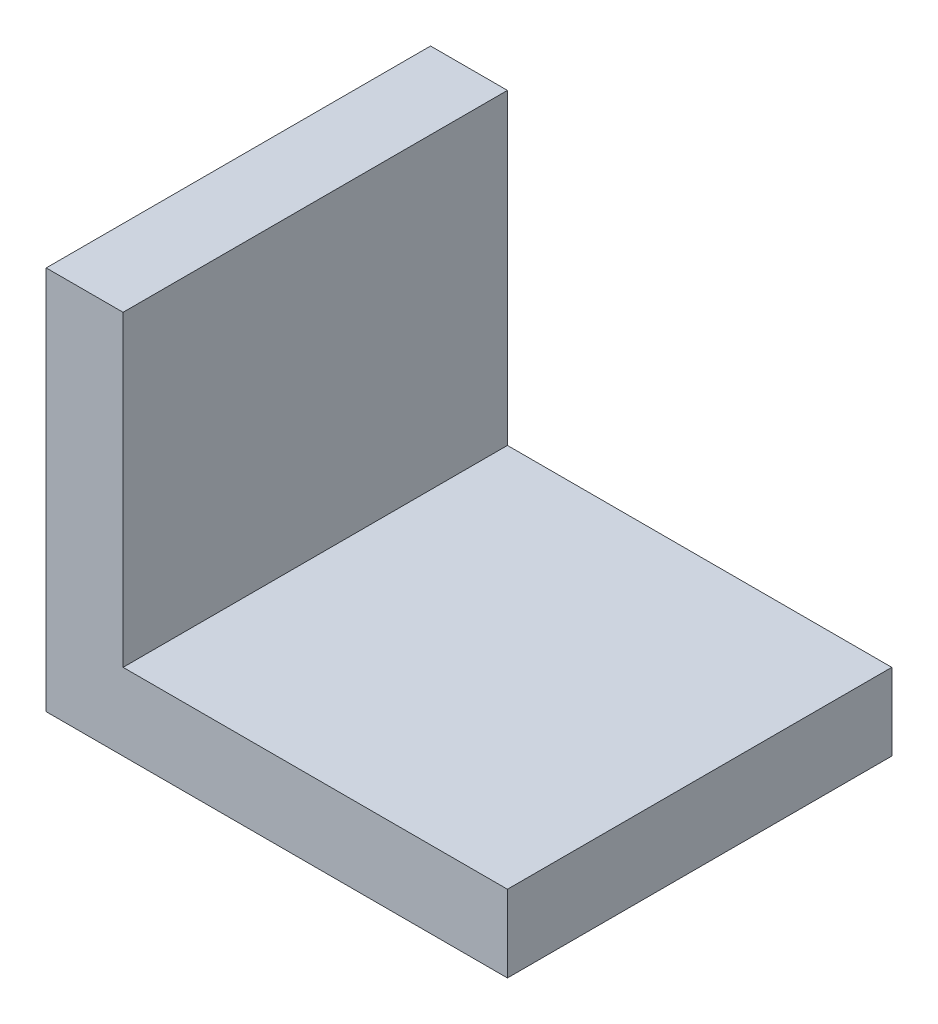
ISO-10303-21;
HEADER;
FILE_DESCRIPTION(('STEP AP214'),'2;1');
FILE_NAME('part.step','',(''),(''),'','','');
FILE_SCHEMA(('AUTOMOTIVE_DESIGN { 1 0 10303 214 1 1 1 1 }'));
ENDSEC;
DATA;
#1=APPLICATION_CONTEXT('core data for automotive mechanical design processes');
#2=APPLICATION_PROTOCOL_DEFINITION('international standard','automotive_design',2000,#1);
#3=PRODUCT_CONTEXT('',#1,'mechanical');
#4=PRODUCT('Part','Part','',(#3));
#5=PRODUCT_RELATED_PRODUCT_CATEGORY('part','',(#4));
#6=PRODUCT_DEFINITION_FORMATION('','',#4);
#7=PRODUCT_DEFINITION_CONTEXT('part definition',#1,'design');
#8=PRODUCT_DEFINITION('design','',#6,#7);
#9=PRODUCT_DEFINITION_SHAPE('','',#8);
#10=(LENGTH_UNIT() NAMED_UNIT(*) SI_UNIT(.MILLI.,.METRE.));
#11=(NAMED_UNIT(*) PLANE_ANGLE_UNIT() SI_UNIT($,.RADIAN.));
#12=(NAMED_UNIT(*) SI_UNIT($,.STERADIAN.) SOLID_ANGLE_UNIT());
#13=UNCERTAINTY_MEASURE_WITH_UNIT(LENGTH_MEASURE(1.E-05),#10,'distance_accuracy_value','');
#14=(GEOMETRIC_REPRESENTATION_CONTEXT(3) GLOBAL_UNCERTAINTY_ASSIGNED_CONTEXT((#13)) GLOBAL_UNIT_ASSIGNED_CONTEXT((#10,
#11,#12)) REPRESENTATION_CONTEXT('',''));
#15=CARTESIAN_POINT('',(0.,0.,0.));
#16=DIRECTION('',(0.,0.,1.));
#17=DIRECTION('',(1.,0.,0.));
#18=AXIS2_PLACEMENT_3D('',#15,#16,#17);
#19=CARTESIAN_POINT('',(6.,2.,-5.));
#20=DIRECTION('',(-1.,0.,0.));
#21=DIRECTION('',(0.,0.,1.));
#22=AXIS2_PLACEMENT_3D('',#19,#20,#21);
#23=PLANE('',#22);
#24=DIRECTION('',(0.,0.,-1.));
#25=VECTOR('',#24,1.);
#26=CARTESIAN_POINT('',(6.,0.,-5.));
#27=LINE('',#26,#25);
#28=CARTESIAN_POINT('',(6.,0.,5.));
#29=VERTEX_POINT('',#28);
#30=CARTESIAN_POINT('',(6.,0.,-5.));
#31=VERTEX_POINT('',#30);
#32=EDGE_CURVE('E97',#29,#31,#27,.T.);
#33=ORIENTED_EDGE('',*,*,#32,.T.);
#34=DIRECTION('',(0.,-1.,0.));
#35=VECTOR('',#34,1.);
#36=CARTESIAN_POINT('',(6.,2.,-5.));
#37=LINE('',#36,#35);
#38=CARTESIAN_POINT('',(6.,2.,-5.));
#39=VERTEX_POINT('',#38);
#40=EDGE_CURVE('E11',#39,#31,#37,.T.);
#41=ORIENTED_EDGE('',*,*,#40,.F.);
#42=DIRECTION('',(0.,0.,-1.));
#43=VECTOR('',#42,1.);
#44=CARTESIAN_POINT('',(6.,2.,-5.));
#45=LINE('',#44,#43);
#46=CARTESIAN_POINT('',(6.,2.,5.));
#47=VERTEX_POINT('',#46);
#48=EDGE_CURVE('E91',#47,#39,#45,.T.);
#49=ORIENTED_EDGE('',*,*,#48,.F.);
#50=DIRECTION('',(0.,-1.,0.));
#51=VECTOR('',#50,1.);
#52=CARTESIAN_POINT('',(6.,2.,5.));
#53=LINE('',#52,#51);
#54=EDGE_CURVE('E82',#47,#29,#53,.T.);
#55=ORIENTED_EDGE('',*,*,#54,.T.);
#56=EDGE_LOOP('',(#33,#41,#49,#55));
#57=FACE_BOUND('',#56,.T.);
#58=ADVANCED_FACE('F39',(#57),#23,.F.);
#59=CARTESIAN_POINT('',(-6.,2.,-5.));
#60=DIRECTION('',(0.,0.,1.));
#61=DIRECTION('',(1.,0.,0.));
#62=AXIS2_PLACEMENT_3D('',#59,#60,#61);
#63=PLANE('',#62);
#64=DIRECTION('',(-1.,0.,0.));
#65=VECTOR('',#64,1.);
#66=CARTESIAN_POINT('',(-6.,0.,-5.));
#67=LINE('',#66,#65);
#68=CARTESIAN_POINT('',(-6.,0.,-5.));
#69=VERTEX_POINT('',#68);
#70=EDGE_CURVE('E101',#31,#69,#67,.T.);
#71=ORIENTED_EDGE('',*,*,#70,.T.);
#72=DIRECTION('',(0.,-1.,0.));
#73=VECTOR('',#72,1.);
#74=CARTESIAN_POINT('',(-6.,2.,-5.));
#75=LINE('',#74,#73);
#76=CARTESIAN_POINT('',(-6.,10.,-5.));
#77=VERTEX_POINT('',#76);
#78=EDGE_CURVE('E47',#77,#69,#75,.T.);
#79=ORIENTED_EDGE('',*,*,#78,.F.);
#80=DIRECTION('',(-1.,0.,0.));
#81=VECTOR('',#80,1.);
#82=CARTESIAN_POINT('',(-6.,10.,-5.));
#83=LINE('',#82,#81);
#84=CARTESIAN_POINT('',(-4.,10.,-5.));
#85=VERTEX_POINT('',#84);
#86=EDGE_CURVE('E131',#85,#77,#83,.T.);
#87=ORIENTED_EDGE('',*,*,#86,.F.);
#88=DIRECTION('',(0.,-1.,0.));
#89=VECTOR('',#88,1.);
#90=CARTESIAN_POINT('',(-4.,10.,-5.));
#91=LINE('',#90,#89);
#92=CARTESIAN_POINT('',(-4.,2.,-5.));
#93=VERTEX_POINT('',#92);
#94=EDGE_CURVE('E109',#85,#93,#91,.T.);
#95=ORIENTED_EDGE('',*,*,#94,.T.);
#96=DIRECTION('',(-1.,0.,0.));
#97=VECTOR('',#96,1.);
#98=CARTESIAN_POINT('',(-6.,2.,-5.));
#99=LINE('',#98,#97);
#100=EDGE_CURVE('E153',#39,#93,#99,.T.);
#101=ORIENTED_EDGE('',*,*,#100,.F.);
#102=ORIENTED_EDGE('',*,*,#40,.T.);
#103=EDGE_LOOP('',(#71,#79,#87,#95,#101,#102));
#104=FACE_BOUND('',#103,.T.);
#105=ADVANCED_FACE('F128',(#104),#63,.F.);
#106=CARTESIAN_POINT('',(-6.,2.,-5.));
#107=DIRECTION('',(1.,0.,0.));
#108=DIRECTION('',(0.,0.,-1.));
#109=AXIS2_PLACEMENT_3D('',#106,#107,#108);
#110=PLANE('',#109);
#111=DIRECTION('',(0.,0.,1.));
#112=VECTOR('',#111,1.);
#113=CARTESIAN_POINT('',(-6.,0.,-5.));
#114=LINE('',#113,#112);
#115=CARTESIAN_POINT('',(-6.,0.,5.));
#116=VERTEX_POINT('',#115);
#117=EDGE_CURVE('E92',#69,#116,#114,.T.);
#118=ORIENTED_EDGE('',*,*,#117,.T.);
#119=DIRECTION('',(0.,-1.,0.));
#120=VECTOR('',#119,1.);
#121=CARTESIAN_POINT('',(-6.,2.,5.));
#122=LINE('',#121,#120);
#123=CARTESIAN_POINT('',(-6.,10.,5.));
#124=VERTEX_POINT('',#123);
#125=EDGE_CURVE('E86',#124,#116,#122,.T.);
#126=ORIENTED_EDGE('',*,*,#125,.F.);
#127=DIRECTION('',(0.,0.,1.));
#128=VECTOR('',#127,1.);
#129=CARTESIAN_POINT('',(-6.,10.,-5.));
#130=LINE('',#129,#128);
#131=EDGE_CURVE('E124',#77,#124,#130,.T.);
#132=ORIENTED_EDGE('',*,*,#131,.F.);
#133=ORIENTED_EDGE('',*,*,#78,.T.);
#134=EDGE_LOOP('',(#118,#126,#132,#133));
#135=FACE_BOUND('',#134,.T.);
#136=ADVANCED_FACE('F122',(#135),#110,.F.);
#137=CARTESIAN_POINT('',(-6.,2.,5.));
#138=DIRECTION('',(0.,0.,-1.));
#139=DIRECTION('',(-1.,0.,0.));
#140=AXIS2_PLACEMENT_3D('',#137,#138,#139);
#141=PLANE('',#140);
#142=DIRECTION('',(1.,0.,0.));
#143=VECTOR('',#142,1.);
#144=CARTESIAN_POINT('',(-6.,0.,5.));
#145=LINE('',#144,#143);
#146=EDGE_CURVE('E79',#116,#29,#145,.T.);
#147=ORIENTED_EDGE('',*,*,#146,.T.);
#148=ORIENTED_EDGE('',*,*,#54,.F.);
#149=DIRECTION('',(1.,0.,0.));
#150=VECTOR('',#149,1.);
#151=CARTESIAN_POINT('',(-6.,2.,5.));
#152=LINE('',#151,#150);
#153=CARTESIAN_POINT('',(-4.,2.,5.));
#154=VERTEX_POINT('',#153);
#155=EDGE_CURVE('E59',#154,#47,#152,.T.);
#156=ORIENTED_EDGE('',*,*,#155,.F.);
#157=DIRECTION('',(0.,-1.,0.));
#158=VECTOR('',#157,1.);
#159=CARTESIAN_POINT('',(-4.,10.,5.));
#160=LINE('',#159,#158);
#161=CARTESIAN_POINT('',(-4.,10.,5.));
#162=VERTEX_POINT('',#161);
#163=EDGE_CURVE('E103',#162,#154,#160,.T.);
#164=ORIENTED_EDGE('',*,*,#163,.F.);
#165=DIRECTION('',(1.,0.,0.));
#166=VECTOR('',#165,1.);
#167=CARTESIAN_POINT('',(-6.,10.,5.));
#168=LINE('',#167,#166);
#169=EDGE_CURVE('E146',#124,#162,#168,.T.);
#170=ORIENTED_EDGE('',*,*,#169,.F.);
#171=ORIENTED_EDGE('',*,*,#125,.T.);
#172=EDGE_LOOP('',(#147,#148,#156,#164,#170,#171));
#173=FACE_BOUND('',#172,.T.);
#174=ADVANCED_FACE('F81',(#173),#141,.F.);
#175=CARTESIAN_POINT('',(0.,2.,0.));
#176=DIRECTION('',(0.,1.,0.));
#177=DIRECTION('',(0.,0.,1.));
#178=AXIS2_PLACEMENT_3D('',#175,#176,#177);
#179=PLANE('',#178);
#180=DIRECTION('',(0.,0.,-1.));
#181=VECTOR('',#180,1.);
#182=CARTESIAN_POINT('',(-4.,2.,-5.));
#183=LINE('',#182,#181);
#184=EDGE_CURVE('E54',#154,#93,#183,.T.);
#185=ORIENTED_EDGE('',*,*,#184,.F.);
#186=ORIENTED_EDGE('',*,*,#155,.T.);
#187=ORIENTED_EDGE('',*,*,#48,.T.);
#188=ORIENTED_EDGE('',*,*,#100,.T.);
#189=EDGE_LOOP('',(#185,#186,#187,#188));
#190=FACE_BOUND('',#189,.T.);
#191=ADVANCED_FACE('F157',(#190),#179,.T.);
#192=CARTESIAN_POINT('',(0.,0.,0.));
#193=DIRECTION('',(0.,1.,0.));
#194=DIRECTION('',(0.,0.,1.));
#195=AXIS2_PLACEMENT_3D('',#192,#193,#194);
#196=PLANE('',#195);
#197=ORIENTED_EDGE('',*,*,#32,.F.);
#198=ORIENTED_EDGE('',*,*,#146,.F.);
#199=ORIENTED_EDGE('',*,*,#117,.F.);
#200=ORIENTED_EDGE('',*,*,#70,.F.);
#201=EDGE_LOOP('',(#197,#198,#199,#200));
#202=FACE_BOUND('',#201,.T.);
#203=ADVANCED_FACE('F100',(#202),#196,.F.);
#204=CARTESIAN_POINT('',(-4.,10.,-5.));
#205=DIRECTION('',(-1.,0.,0.));
#206=DIRECTION('',(0.,0.,1.));
#207=AXIS2_PLACEMENT_3D('',#204,#205,#206);
#208=PLANE('',#207);
#209=ORIENTED_EDGE('',*,*,#184,.T.);
#210=ORIENTED_EDGE('',*,*,#94,.F.);
#211=DIRECTION('',(0.,0.,-1.));
#212=VECTOR('',#211,1.);
#213=CARTESIAN_POINT('',(-4.,10.,-5.));
#214=LINE('',#213,#212);
#215=EDGE_CURVE('E139',#162,#85,#214,.T.);
#216=ORIENTED_EDGE('',*,*,#215,.F.);
#217=ORIENTED_EDGE('',*,*,#163,.T.);
#218=EDGE_LOOP('',(#209,#210,#216,#217));
#219=FACE_BOUND('',#218,.T.);
#220=ADVANCED_FACE('F159',(#219),#208,.F.);
#221=CARTESIAN_POINT('',(0.,10.,0.));
#222=DIRECTION('',(0.,1.,0.));
#223=DIRECTION('',(0.,0.,1.));
#224=AXIS2_PLACEMENT_3D('',#221,#222,#223);
#225=PLANE('',#224);
#226=ORIENTED_EDGE('',*,*,#131,.T.);
#227=ORIENTED_EDGE('',*,*,#169,.T.);
#228=ORIENTED_EDGE('',*,*,#215,.T.);
#229=ORIENTED_EDGE('',*,*,#86,.T.);
#230=EDGE_LOOP('',(#226,#227,#228,#229));
#231=FACE_BOUND('',#230,.T.);
#232=ADVANCED_FACE('F135',(#231),#225,.T.);
#233=CLOSED_SHELL('',(#58,#105,#136,#174,#191,#203,#220,#232));
#234=MANIFOLD_SOLID_BREP('B2',#233);
#235=ADVANCED_BREP_SHAPE_REPRESENTATION('',(#18,#234),#14);
#236=SHAPE_DEFINITION_REPRESENTATION(#9,#235);
ENDSEC;
END-ISO-10303-21;
